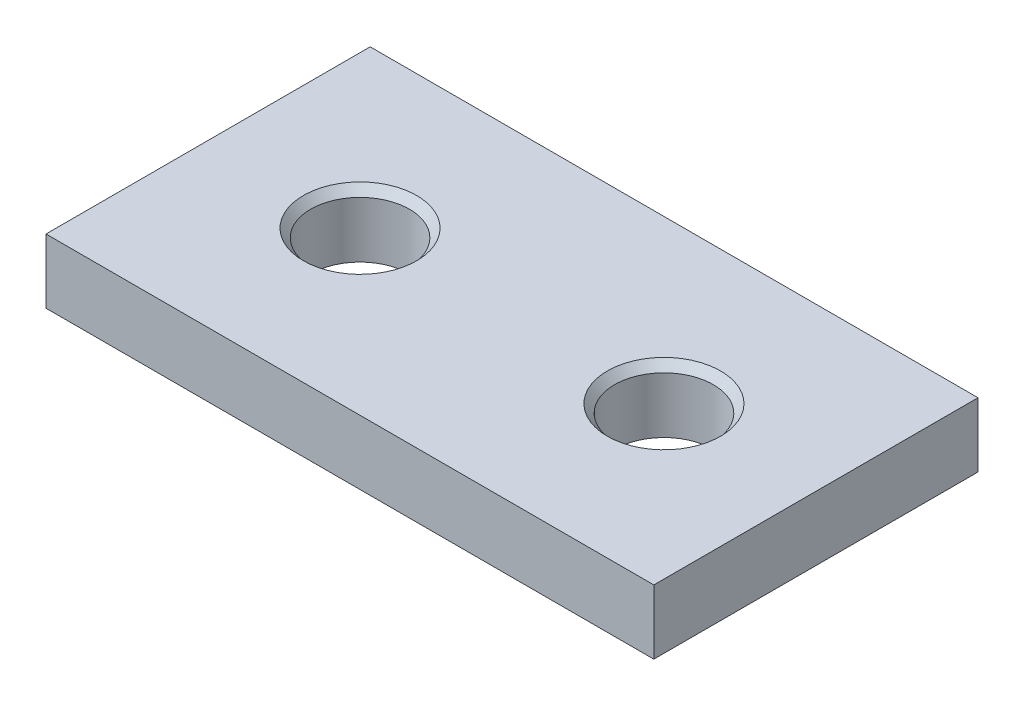
ISO-10303-21;
HEADER;
FILE_DESCRIPTION(('STEP AP214'),'2;1');
FILE_NAME('part.step','',(''),(''),'','','');
FILE_SCHEMA(('AUTOMOTIVE_DESIGN { 1 0 10303 214 1 1 1 1 }'));
ENDSEC;
DATA;
#1=APPLICATION_CONTEXT('core data for automotive mechanical design processes');
#2=APPLICATION_PROTOCOL_DEFINITION('international standard','automotive_design',2000,#1);
#3=PRODUCT_CONTEXT('',#1,'mechanical');
#4=PRODUCT('Part','Part','',(#3));
#5=PRODUCT_RELATED_PRODUCT_CATEGORY('part','',(#4));
#6=PRODUCT_DEFINITION_FORMATION('','',#4);
#7=PRODUCT_DEFINITION_CONTEXT('part definition',#1,'design');
#8=PRODUCT_DEFINITION('design','',#6,#7);
#9=PRODUCT_DEFINITION_SHAPE('','',#8);
#10=(LENGTH_UNIT() NAMED_UNIT(*) SI_UNIT(.MILLI.,.METRE.));
#11=(NAMED_UNIT(*) PLANE_ANGLE_UNIT() SI_UNIT($,.RADIAN.));
#12=(NAMED_UNIT(*) SI_UNIT($,.STERADIAN.) SOLID_ANGLE_UNIT());
#13=UNCERTAINTY_MEASURE_WITH_UNIT(LENGTH_MEASURE(1.E-05),#10,'distance_accuracy_value','');
#14=(GEOMETRIC_REPRESENTATION_CONTEXT(3) GLOBAL_UNCERTAINTY_ASSIGNED_CONTEXT((#13)) GLOBAL_UNIT_ASSIGNED_CONTEXT((#10,
#11,#12)) REPRESENTATION_CONTEXT('',''));
#15=CARTESIAN_POINT('',(0.,0.,0.));
#16=DIRECTION('',(0.,0.,1.));
#17=DIRECTION('',(1.,0.,0.));
#18=AXIS2_PLACEMENT_3D('',#15,#16,#17);
#19=CARTESIAN_POINT('',(7.5,1.5875,-4.));
#20=DIRECTION('',(-1.,0.,0.));
#21=DIRECTION('',(0.,0.,1.));
#22=AXIS2_PLACEMENT_3D('',#19,#20,#21);
#23=PLANE('',#22);
#24=DIRECTION('',(0.,0.,-1.));
#25=VECTOR('',#24,1.);
#26=CARTESIAN_POINT('',(7.5,0.,-4.));
#27=LINE('',#26,#25);
#28=CARTESIAN_POINT('',(7.5,0.,4.));
#29=VERTEX_POINT('',#28);
#30=CARTESIAN_POINT('',(7.5,0.,-4.));
#31=VERTEX_POINT('',#30);
#32=EDGE_CURVE('E98',#29,#31,#27,.T.);
#33=ORIENTED_EDGE('',*,*,#32,.T.);
#34=DIRECTION('',(0.,-1.,0.));
#35=VECTOR('',#34,1.);
#36=CARTESIAN_POINT('',(7.5,1.5875,-4.));
#37=LINE('',#36,#35);
#38=CARTESIAN_POINT('',(7.5,1.5875,-4.));
#39=VERTEX_POINT('',#38);
#40=EDGE_CURVE('E11',#39,#31,#37,.T.);
#41=ORIENTED_EDGE('',*,*,#40,.F.);
#42=DIRECTION('',(0.,0.,-1.));
#43=VECTOR('',#42,1.);
#44=CARTESIAN_POINT('',(7.5,1.5875,-4.));
#45=LINE('',#44,#43);
#46=CARTESIAN_POINT('',(7.5,1.5875,4.));
#47=VERTEX_POINT('',#46);
#48=EDGE_CURVE('E85',#47,#39,#45,.T.);
#49=ORIENTED_EDGE('',*,*,#48,.F.);
#50=DIRECTION('',(0.,-1.,0.));
#51=VECTOR('',#50,1.);
#52=CARTESIAN_POINT('',(7.5,1.5875,4.));
#53=LINE('',#52,#51);
#54=EDGE_CURVE('E94',#47,#29,#53,.T.);
#55=ORIENTED_EDGE('',*,*,#54,.T.);
#56=EDGE_LOOP('',(#33,#41,#49,#55));
#57=FACE_BOUND('',#56,.T.);
#58=ADVANCED_FACE('F32',(#57),#23,.F.);
#59=CARTESIAN_POINT('',(-7.5,1.5875,-4.));
#60=DIRECTION('',(0.,0.,1.));
#61=DIRECTION('',(1.,0.,0.));
#62=AXIS2_PLACEMENT_3D('',#59,#60,#61);
#63=PLANE('',#62);
#64=DIRECTION('',(-1.,0.,0.));
#65=VECTOR('',#64,1.);
#66=CARTESIAN_POINT('',(-7.5,0.,-4.));
#67=LINE('',#66,#65);
#68=CARTESIAN_POINT('',(-7.5,0.,-4.));
#69=VERTEX_POINT('',#68);
#70=EDGE_CURVE('E89',#31,#69,#67,.T.);
#71=ORIENTED_EDGE('',*,*,#70,.T.);
#72=DIRECTION('',(0.,-1.,0.));
#73=VECTOR('',#72,1.);
#74=CARTESIAN_POINT('',(-7.5,1.5875,-4.));
#75=LINE('',#74,#73);
#76=CARTESIAN_POINT('',(-7.5,1.5875,-4.));
#77=VERTEX_POINT('',#76);
#78=EDGE_CURVE('E41',#77,#69,#75,.T.);
#79=ORIENTED_EDGE('',*,*,#78,.F.);
#80=DIRECTION('',(-1.,0.,0.));
#81=VECTOR('',#80,1.);
#82=CARTESIAN_POINT('',(-7.5,1.5875,-4.));
#83=LINE('',#82,#81);
#84=EDGE_CURVE('E80',#39,#77,#83,.T.);
#85=ORIENTED_EDGE('',*,*,#84,.F.);
#86=ORIENTED_EDGE('',*,*,#40,.T.);
#87=EDGE_LOOP('',(#71,#79,#85,#86));
#88=FACE_BOUND('',#87,.T.);
#89=ADVANCED_FACE('F88',(#88),#63,.F.);
#90=CARTESIAN_POINT('',(-7.5,1.5875,-4.));
#91=DIRECTION('',(1.,0.,0.));
#92=DIRECTION('',(0.,0.,-1.));
#93=AXIS2_PLACEMENT_3D('',#90,#91,#92);
#94=PLANE('',#93);
#95=DIRECTION('',(0.,0.,1.));
#96=VECTOR('',#95,1.);
#97=CARTESIAN_POINT('',(-7.5,0.,-4.));
#98=LINE('',#97,#96);
#99=CARTESIAN_POINT('',(-7.5,0.,4.));
#100=VERTEX_POINT('',#99);
#101=EDGE_CURVE('E67',#69,#100,#98,.T.);
#102=ORIENTED_EDGE('',*,*,#101,.T.);
#103=DIRECTION('',(0.,-1.,0.));
#104=VECTOR('',#103,1.);
#105=CARTESIAN_POINT('',(-7.5,1.5875,4.));
#106=LINE('',#105,#104);
#107=CARTESIAN_POINT('',(-7.5,1.5875,4.));
#108=VERTEX_POINT('',#107);
#109=EDGE_CURVE('E90',#108,#100,#106,.T.);
#110=ORIENTED_EDGE('',*,*,#109,.F.);
#111=DIRECTION('',(0.,0.,1.));
#112=VECTOR('',#111,1.);
#113=CARTESIAN_POINT('',(-7.5,1.5875,-4.));
#114=LINE('',#113,#112);
#115=EDGE_CURVE('E83',#77,#108,#114,.T.);
#116=ORIENTED_EDGE('',*,*,#115,.F.);
#117=ORIENTED_EDGE('',*,*,#78,.T.);
#118=EDGE_LOOP('',(#102,#110,#116,#117));
#119=FACE_BOUND('',#118,.T.);
#120=ADVANCED_FACE('F92',(#119),#94,.F.);
#121=CARTESIAN_POINT('',(-7.5,1.5875,4.));
#122=DIRECTION('',(0.,0.,-1.));
#123=DIRECTION('',(-1.,0.,0.));
#124=AXIS2_PLACEMENT_3D('',#121,#122,#123);
#125=PLANE('',#124);
#126=DIRECTION('',(1.,0.,0.));
#127=VECTOR('',#126,1.);
#128=CARTESIAN_POINT('',(-7.5,0.,4.));
#129=LINE('',#128,#127);
#130=EDGE_CURVE('E73',#100,#29,#129,.T.);
#131=ORIENTED_EDGE('',*,*,#130,.T.);
#132=ORIENTED_EDGE('',*,*,#54,.F.);
#133=DIRECTION('',(1.,0.,0.));
#134=VECTOR('',#133,1.);
#135=CARTESIAN_POINT('',(-7.5,1.5875,4.));
#136=LINE('',#135,#134);
#137=EDGE_CURVE('E50',#108,#47,#136,.T.);
#138=ORIENTED_EDGE('',*,*,#137,.F.);
#139=ORIENTED_EDGE('',*,*,#109,.T.);
#140=EDGE_LOOP('',(#131,#132,#138,#139));
#141=FACE_BOUND('',#140,.T.);
#142=ADVANCED_FACE('F130',(#141),#125,.F.);
#143=CARTESIAN_POINT('',(0.,1.5875,0.));
#144=DIRECTION('',(0.,1.,0.));
#145=DIRECTION('',(0.,0.,1.));
#146=AXIS2_PLACEMENT_3D('',#143,#144,#145);
#147=PLANE('',#146);
#148=CARTESIAN_POINT('',(-3.75,1.5875,0.));
#149=DIRECTION('',(0.,1.,0.));
#150=DIRECTION('',(0.,0.,1.));
#151=AXIS2_PLACEMENT_3D('',#148,#149,#150);
#152=CIRCLE('',#151,1.397);
#153=CARTESIAN_POINT('',(-3.75,1.5875,1.397));
#154=VERTEX_POINT('',#153);
#155=EDGE_CURVE('E121',#154,#154,#152,.T.);
#156=ORIENTED_EDGE('',*,*,#155,.F.);
#157=EDGE_LOOP('',(#156));
#158=FACE_BOUND('',#157,.T.);
#159=CARTESIAN_POINT('',(3.75,1.5875,0.));
#160=DIRECTION('',(0.,1.,0.));
#161=DIRECTION('',(0.,0.,1.));
#162=AXIS2_PLACEMENT_3D('',#159,#160,#161);
#163=CIRCLE('',#162,1.397);
#164=CARTESIAN_POINT('',(3.75,1.5875,1.397));
#165=VERTEX_POINT('',#164);
#166=EDGE_CURVE('E111',#165,#165,#163,.T.);
#167=ORIENTED_EDGE('',*,*,#166,.F.);
#168=EDGE_LOOP('',(#167));
#169=FACE_BOUND('',#168,.T.);
#170=ORIENTED_EDGE('',*,*,#48,.T.);
#171=ORIENTED_EDGE('',*,*,#84,.T.);
#172=ORIENTED_EDGE('',*,*,#115,.T.);
#173=ORIENTED_EDGE('',*,*,#137,.T.);
#174=EDGE_LOOP('',(#170,#171,#172,#173));
#175=FACE_BOUND('',#174,.T.);
#176=ADVANCED_FACE('F81',(#158,#169,#175),#147,.T.);
#177=CARTESIAN_POINT('',(0.,0.,0.));
#178=DIRECTION('',(0.,1.,0.));
#179=DIRECTION('',(0.,0.,1.));
#180=AXIS2_PLACEMENT_3D('',#177,#178,#179);
#181=PLANE('',#180);
#182=CARTESIAN_POINT('',(-3.75,0.,0.));
#183=DIRECTION('',(0.,1.,0.));
#184=DIRECTION('',(0.,0.,1.));
#185=AXIS2_PLACEMENT_3D('',#182,#183,#184);
#186=CIRCLE('',#185,1.21919999999999);
#187=CARTESIAN_POINT('',(-3.75,0.,1.21919999999999));
#188=VERTEX_POINT('',#187);
#189=EDGE_CURVE('E35',#188,#188,#186,.T.);
#190=ORIENTED_EDGE('',*,*,#189,.T.);
#191=EDGE_LOOP('',(#190));
#192=FACE_BOUND('',#191,.T.);
#193=CARTESIAN_POINT('',(3.75,0.,0.));
#194=DIRECTION('',(0.,1.,0.));
#195=DIRECTION('',(0.,0.,1.));
#196=AXIS2_PLACEMENT_3D('',#193,#194,#195);
#197=CIRCLE('',#196,1.21919999999999);
#198=CARTESIAN_POINT('',(3.75,0.,1.21919999999999));
#199=VERTEX_POINT('',#198);
#200=EDGE_CURVE('E101',#199,#199,#197,.T.);
#201=ORIENTED_EDGE('',*,*,#200,.T.);
#202=EDGE_LOOP('',(#201));
#203=FACE_BOUND('',#202,.T.);
#204=ORIENTED_EDGE('',*,*,#32,.F.);
#205=ORIENTED_EDGE('',*,*,#130,.F.);
#206=ORIENTED_EDGE('',*,*,#101,.F.);
#207=ORIENTED_EDGE('',*,*,#70,.F.);
#208=EDGE_LOOP('',(#204,#205,#206,#207));
#209=FACE_BOUND('',#208,.T.);
#210=ADVANCED_FACE('F129',(#192,#203,#209),#181,.F.);
#211=CARTESIAN_POINT('',(3.75,1.5875,0.));
#212=DIRECTION('',(0.,1.,0.));
#213=DIRECTION('',(0.,0.,1.));
#214=AXIS2_PLACEMENT_3D('',#211,#212,#213);
#215=CYLINDRICAL_SURFACE('',#214,1.21919999999999);
#216=CARTESIAN_POINT('',(3.75,1.38296449719611,0.));
#217=DIRECTION('',(0.,1.,0.));
#218=DIRECTION('',(0.,0.,1.));
#219=AXIS2_PLACEMENT_3D('',#216,#217,#218);
#220=CIRCLE('',#219,1.21919999999999);
#221=CARTESIAN_POINT('',(3.75,1.38296449719611,1.21919999999999));
#222=VERTEX_POINT('',#221);
#223=EDGE_CURVE('E107',#222,#222,#220,.T.);
#224=ORIENTED_EDGE('',*,*,#223,.T.);
#225=EDGE_LOOP('',(#224));
#226=FACE_BOUND('',#225,.T.);
#227=ORIENTED_EDGE('',*,*,#200,.F.);
#228=EDGE_LOOP('',(#227));
#229=FACE_BOUND('',#228,.T.);
#230=ADVANCED_FACE('F137',(#226,#229),#215,.F.);
#231=CARTESIAN_POINT('',(3.75,1.5875,0.));
#232=DIRECTION('',(0.,1.,0.));
#233=DIRECTION('',(0.,0.,1.));
#234=AXIS2_PLACEMENT_3D('',#231,#232,#233);
#235=CONICAL_SURFACE('',#234,1.397,0.715584993317716);
#236=ORIENTED_EDGE('',*,*,#223,.F.);
#237=EDGE_LOOP('',(#236));
#238=FACE_BOUND('',#237,.T.);
#239=ORIENTED_EDGE('',*,*,#166,.T.);
#240=EDGE_LOOP('',(#239));
#241=FACE_BOUND('',#240,.T.);
#242=ADVANCED_FACE('F134',(#238,#241),#235,.F.);
#243=CARTESIAN_POINT('',(-3.75,1.5875,0.));
#244=DIRECTION('',(0.,1.,0.));
#245=DIRECTION('',(0.,0.,1.));
#246=AXIS2_PLACEMENT_3D('',#243,#244,#245);
#247=CYLINDRICAL_SURFACE('',#246,1.21919999999999);
#248=CARTESIAN_POINT('',(-3.75,1.38296449719611,0.));
#249=DIRECTION('',(0.,1.,0.));
#250=DIRECTION('',(0.,0.,1.));
#251=AXIS2_PLACEMENT_3D('',#248,#249,#250);
#252=CIRCLE('',#251,1.21919999999999);
#253=CARTESIAN_POINT('',(-3.75,1.38296449719611,1.21919999999999));
#254=VERTEX_POINT('',#253);
#255=EDGE_CURVE('E118',#254,#254,#252,.T.);
#256=ORIENTED_EDGE('',*,*,#255,.T.);
#257=EDGE_LOOP('',(#256));
#258=FACE_BOUND('',#257,.T.);
#259=ORIENTED_EDGE('',*,*,#189,.F.);
#260=EDGE_LOOP('',(#259));
#261=FACE_BOUND('',#260,.T.);
#262=ADVANCED_FACE('F136',(#258,#261),#247,.F.);
#263=CARTESIAN_POINT('',(-3.75,1.5875,0.));
#264=DIRECTION('',(0.,1.,0.));
#265=DIRECTION('',(0.,0.,1.));
#266=AXIS2_PLACEMENT_3D('',#263,#264,#265);
#267=CONICAL_SURFACE('',#266,1.397,0.715584993317716);
#268=ORIENTED_EDGE('',*,*,#255,.F.);
#269=EDGE_LOOP('',(#268));
#270=FACE_BOUND('',#269,.T.);
#271=ORIENTED_EDGE('',*,*,#155,.T.);
#272=EDGE_LOOP('',(#271));
#273=FACE_BOUND('',#272,.T.);
#274=ADVANCED_FACE('F125',(#270,#273),#267,.F.);
#275=CLOSED_SHELL('',(#58,#89,#120,#142,#176,#210,#230,#242,#262,#274));
#276=MANIFOLD_SOLID_BREP('B2',#275);
#277=ADVANCED_BREP_SHAPE_REPRESENTATION('',(#18,#276),#14);
#278=SHAPE_DEFINITION_REPRESENTATION(#9,#277);
ENDSEC;
END-ISO-10303-21;
